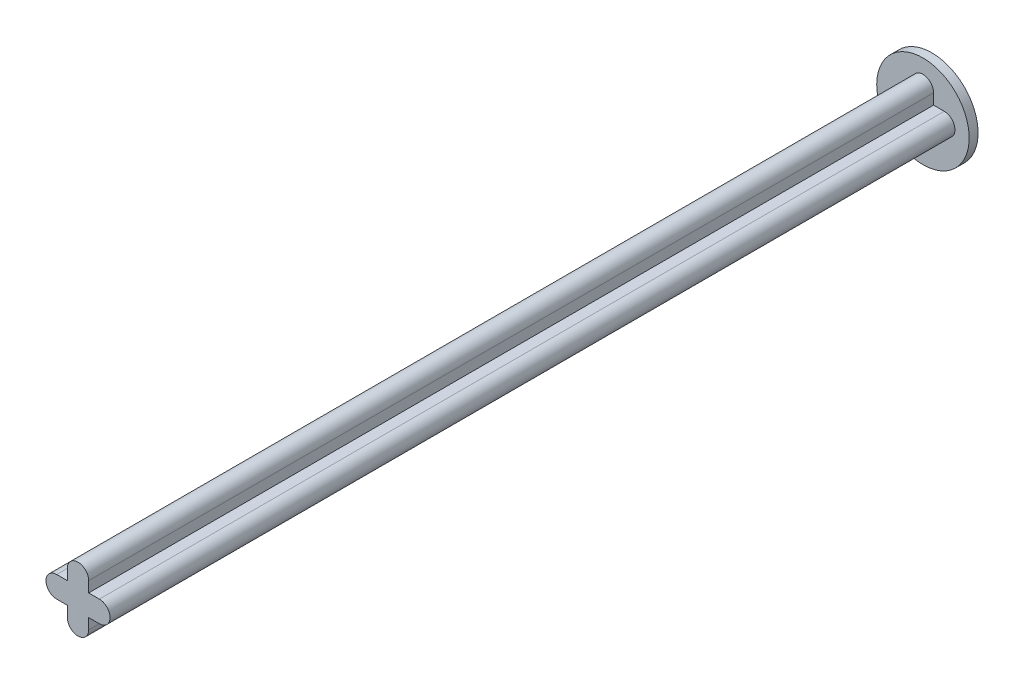
ISO-10303-21;
HEADER;
FILE_DESCRIPTION(('STEP AP214'),'2;1');
FILE_NAME('part.step','',(''),(''),'','','');
FILE_SCHEMA(('AUTOMOTIVE_DESIGN { 1 0 10303 214 1 1 1 1 }'));
ENDSEC;
DATA;
#1=APPLICATION_CONTEXT('core data for automotive mechanical design processes');
#2=APPLICATION_PROTOCOL_DEFINITION('international standard','automotive_design',2000,#1);
#3=PRODUCT_CONTEXT('',#1,'mechanical');
#4=PRODUCT('Part','Part','',(#3));
#5=PRODUCT_RELATED_PRODUCT_CATEGORY('part','',(#4));
#6=PRODUCT_DEFINITION_FORMATION('','',#4);
#7=PRODUCT_DEFINITION_CONTEXT('part definition',#1,'design');
#8=PRODUCT_DEFINITION('design','',#6,#7);
#9=PRODUCT_DEFINITION_SHAPE('','',#8);
#10=(LENGTH_UNIT() NAMED_UNIT(*) SI_UNIT(.MILLI.,.METRE.));
#11=(NAMED_UNIT(*) PLANE_ANGLE_UNIT() SI_UNIT($,.RADIAN.));
#12=(NAMED_UNIT(*) SI_UNIT($,.STERADIAN.) SOLID_ANGLE_UNIT());
#13=UNCERTAINTY_MEASURE_WITH_UNIT(LENGTH_MEASURE(1.E-05),#10,'distance_accuracy_value','');
#14=(GEOMETRIC_REPRESENTATION_CONTEXT(3) GLOBAL_UNCERTAINTY_ASSIGNED_CONTEXT((#13)) GLOBAL_UNIT_ASSIGNED_CONTEXT((#10,
#11,#12)) REPRESENTATION_CONTEXT('',''));
#15=CARTESIAN_POINT('',(0.,0.,0.));
#16=DIRECTION('',(0.,0.,1.));
#17=DIRECTION('',(1.,0.,0.));
#18=AXIS2_PLACEMENT_3D('',#15,#16,#17);
#19=CARTESIAN_POINT('',(1.524,0.762,60.96));
#20=DIRECTION('',(0.,1.,0.));
#21=DIRECTION('',(0.,0.,1.));
#22=AXIS2_PLACEMENT_3D('',#19,#20,#21);
#23=PLANE('',#22);
#24=DIRECTION('',(0.,0.,-1.));
#25=VECTOR('',#24,1.);
#26=CARTESIAN_POINT('',(0.762000000000001,0.762,60.96));
#27=LINE('',#26,#25);
#28=CARTESIAN_POINT('',(0.762000000000001,0.762,60.96));
#29=VERTEX_POINT('',#28);
#30=CARTESIAN_POINT('',(0.762000000000001,0.762,0.635000000000011));
#31=VERTEX_POINT('',#30);
#32=EDGE_CURVE('E134',#29,#31,#27,.T.);
#33=ORIENTED_EDGE('',*,*,#32,.T.);
#34=DIRECTION('',(-1.,0.,0.));
#35=VECTOR('',#34,1.);
#36=CARTESIAN_POINT('',(1.524,0.762,0.634999999999997));
#37=LINE('',#36,#35);
#38=CARTESIAN_POINT('',(0.,0.762,0.635000000000011));
#39=VERTEX_POINT('',#38);
#40=EDGE_CURVE('E50',#31,#39,#37,.T.);
#41=ORIENTED_EDGE('',*,*,#40,.T.);
#42=DIRECTION('',(0.,0.,-1.));
#43=VECTOR('',#42,1.);
#44=CARTESIAN_POINT('',(0.,0.762,60.96));
#45=LINE('',#44,#43);
#46=CARTESIAN_POINT('',(0.,0.762,60.96));
#47=VERTEX_POINT('',#46);
#48=EDGE_CURVE('E43',#47,#39,#45,.T.);
#49=ORIENTED_EDGE('',*,*,#48,.F.);
#50=DIRECTION('',(1.,0.,0.));
#51=VECTOR('',#50,1.);
#52=CARTESIAN_POINT('',(1.524,0.762,60.96));
#53=LINE('',#52,#51);
#54=EDGE_CURVE('E148',#47,#29,#53,.T.);
#55=ORIENTED_EDGE('',*,*,#54,.T.);
#56=EDGE_LOOP('',(#33,#41,#49,#55));
#57=FACE_BOUND('',#56,.T.);
#58=ADVANCED_FACE('F36',(#57),#23,.T.);
#59=CARTESIAN_POINT('',(0.,0.,60.96));
#60=DIRECTION('',(0.,0.,-1.));
#61=DIRECTION('',(-1.,0.,0.));
#62=AXIS2_PLACEMENT_3D('',#59,#60,#61);
#63=CYLINDRICAL_SURFACE('',#62,0.762);
#64=CARTESIAN_POINT('',(0.,0.,0.634999999999997));
#65=DIRECTION('',(0.,0.,-1.));
#66=DIRECTION('',(-1.,0.,0.));
#67=AXIS2_PLACEMENT_3D('',#64,#65,#66);
#68=CIRCLE('',#67,0.762);
#69=CARTESIAN_POINT('',(0.,-0.762,0.635000000000011));
#70=VERTEX_POINT('',#69);
#71=EDGE_CURVE('E57',#70,#39,#68,.T.);
#72=ORIENTED_EDGE('',*,*,#71,.F.);
#73=DIRECTION('',(0.,0.,-1.));
#74=VECTOR('',#73,1.);
#75=CARTESIAN_POINT('',(0.,-0.762,60.96));
#76=LINE('',#75,#74);
#77=CARTESIAN_POINT('',(0.,-0.762,60.96));
#78=VERTEX_POINT('',#77);
#79=EDGE_CURVE('E203',#78,#70,#76,.T.);
#80=ORIENTED_EDGE('',*,*,#79,.F.);
#81=CARTESIAN_POINT('',(0.,0.,60.96));
#82=DIRECTION('',(0.,0.,1.));
#83=DIRECTION('',(1.,0.,0.));
#84=AXIS2_PLACEMENT_3D('',#81,#82,#83);
#85=CIRCLE('',#84,0.762);
#86=EDGE_CURVE('E151',#47,#78,#85,.T.);
#87=ORIENTED_EDGE('',*,*,#86,.F.);
#88=ORIENTED_EDGE('',*,*,#48,.T.);
#89=EDGE_LOOP('',(#72,#80,#87,#88));
#90=FACE_BOUND('',#89,.T.);
#91=ADVANCED_FACE('F205',(#90),#63,.T.);
#92=CARTESIAN_POINT('',(1.524,-0.762,60.96));
#93=DIRECTION('',(0.,1.,0.));
#94=DIRECTION('',(0.,0.,1.));
#95=AXIS2_PLACEMENT_3D('',#92,#93,#94);
#96=PLANE('',#95);
#97=DIRECTION('',(-1.,0.,0.));
#98=VECTOR('',#97,1.);
#99=CARTESIAN_POINT('',(1.524,-0.762,0.634999999999997));
#100=LINE('',#99,#98);
#101=CARTESIAN_POINT('',(0.762000000000001,-0.762,0.635000000000011));
#102=VERTEX_POINT('',#101);
#103=EDGE_CURVE('E153',#102,#70,#100,.T.);
#104=ORIENTED_EDGE('',*,*,#103,.F.);
#105=DIRECTION('',(0.,0.,-1.));
#106=VECTOR('',#105,1.);
#107=CARTESIAN_POINT('',(0.762000000000001,-0.762,60.96));
#108=LINE('',#107,#106);
#109=CARTESIAN_POINT('',(0.762000000000001,-0.762,60.96));
#110=VERTEX_POINT('',#109);
#111=EDGE_CURVE('E200',#110,#102,#108,.T.);
#112=ORIENTED_EDGE('',*,*,#111,.F.);
#113=DIRECTION('',(1.,0.,0.));
#114=VECTOR('',#113,1.);
#115=CARTESIAN_POINT('',(1.524,-0.762,60.96));
#116=LINE('',#115,#114);
#117=EDGE_CURVE('E158',#78,#110,#116,.T.);
#118=ORIENTED_EDGE('',*,*,#117,.F.);
#119=ORIENTED_EDGE('',*,*,#79,.T.);
#120=EDGE_LOOP('',(#104,#112,#118,#119));
#121=FACE_BOUND('',#120,.T.);
#122=ADVANCED_FACE('F234',(#121),#96,.F.);
#123=CARTESIAN_POINT('',(0.762000000000001,-4.4302164435667,60.96));
#124=DIRECTION('',(1.,0.,0.));
#125=DIRECTION('',(0.,0.,-1.));
#126=AXIS2_PLACEMENT_3D('',#123,#124,#125);
#127=PLANE('',#126);
#128=DIRECTION('',(0.,1.,0.));
#129=VECTOR('',#128,1.);
#130=CARTESIAN_POINT('',(0.762000000000001,-4.4302164435667,0.634999999999997));
#131=LINE('',#130,#129);
#132=CARTESIAN_POINT('',(0.762000000000001,-1.524,0.635000000000011));
#133=VERTEX_POINT('',#132);
#134=EDGE_CURVE('E230',#133,#102,#131,.T.);
#135=ORIENTED_EDGE('',*,*,#134,.F.);
#136=DIRECTION('',(0.,0.,-1.));
#137=VECTOR('',#136,1.);
#138=CARTESIAN_POINT('',(0.762000000000001,-1.524,60.96));
#139=LINE('',#138,#137);
#140=CARTESIAN_POINT('',(0.762000000000001,-1.524,60.96));
#141=VERTEX_POINT('',#140);
#142=EDGE_CURVE('E197',#141,#133,#139,.T.);
#143=ORIENTED_EDGE('',*,*,#142,.F.);
#144=DIRECTION('',(0.,-1.,0.));
#145=VECTOR('',#144,1.);
#146=CARTESIAN_POINT('',(0.762000000000001,-4.4302164435667,60.96));
#147=LINE('',#146,#145);
#148=EDGE_CURVE('E160',#110,#141,#147,.T.);
#149=ORIENTED_EDGE('',*,*,#148,.F.);
#150=ORIENTED_EDGE('',*,*,#111,.T.);
#151=EDGE_LOOP('',(#135,#143,#149,#150));
#152=FACE_BOUND('',#151,.T.);
#153=ADVANCED_FACE('F238',(#152),#127,.F.);
#154=CARTESIAN_POINT('',(1.524,-1.524,60.96));
#155=DIRECTION('',(0.,0.,-1.));
#156=DIRECTION('',(-1.,0.,0.));
#157=AXIS2_PLACEMENT_3D('',#154,#155,#156);
#158=CYLINDRICAL_SURFACE('',#157,0.761999999999999);
#159=CARTESIAN_POINT('',(1.524,-1.524,0.634999999999997));
#160=DIRECTION('',(0.,0.,-1.));
#161=DIRECTION('',(-1.,0.,0.));
#162=AXIS2_PLACEMENT_3D('',#159,#160,#161);
#163=CIRCLE('',#162,0.761999999999999);
#164=CARTESIAN_POINT('',(2.286,-1.524,0.635000000000011));
#165=VERTEX_POINT('',#164);
#166=EDGE_CURVE('E227',#165,#133,#163,.T.);
#167=ORIENTED_EDGE('',*,*,#166,.F.);
#168=DIRECTION('',(0.,0.,-1.));
#169=VECTOR('',#168,1.);
#170=CARTESIAN_POINT('',(2.286,-1.524,60.96));
#171=LINE('',#170,#169);
#172=CARTESIAN_POINT('',(2.286,-1.524,60.96));
#173=VERTEX_POINT('',#172);
#174=EDGE_CURVE('E194',#173,#165,#171,.T.);
#175=ORIENTED_EDGE('',*,*,#174,.F.);
#176=CARTESIAN_POINT('',(1.524,-1.524,60.96));
#177=DIRECTION('',(0.,0.,1.));
#178=DIRECTION('',(1.,0.,0.));
#179=AXIS2_PLACEMENT_3D('',#176,#177,#178);
#180=CIRCLE('',#179,0.761999999999999);
#181=EDGE_CURVE('E162',#141,#173,#180,.T.);
#182=ORIENTED_EDGE('',*,*,#181,.F.);
#183=ORIENTED_EDGE('',*,*,#142,.T.);
#184=EDGE_LOOP('',(#167,#175,#182,#183));
#185=FACE_BOUND('',#184,.T.);
#186=ADVANCED_FACE('F244',(#185),#158,.T.);
#187=CARTESIAN_POINT('',(2.286,-4.4302164435667,60.96));
#188=DIRECTION('',(1.,0.,0.));
#189=DIRECTION('',(0.,0.,-1.));
#190=AXIS2_PLACEMENT_3D('',#187,#188,#189);
#191=PLANE('',#190);
#192=ORIENTED_EDGE('',*,*,#174,.T.);
#193=DIRECTION('',(0.,1.,0.));
#194=VECTOR('',#193,1.);
#195=CARTESIAN_POINT('',(2.286,-4.4302164435667,0.634999999999997));
#196=LINE('',#195,#194);
#197=CARTESIAN_POINT('',(2.286,-0.762,0.635000000000011));
#198=VERTEX_POINT('',#197);
#199=EDGE_CURVE('E225',#165,#198,#196,.T.);
#200=ORIENTED_EDGE('',*,*,#199,.T.);
#201=DIRECTION('',(0.,0.,-1.));
#202=VECTOR('',#201,1.);
#203=CARTESIAN_POINT('',(2.286,-0.762,60.96));
#204=LINE('',#203,#202);
#205=CARTESIAN_POINT('',(2.286,-0.762,60.96));
#206=VERTEX_POINT('',#205);
#207=EDGE_CURVE('E191',#206,#198,#204,.T.);
#208=ORIENTED_EDGE('',*,*,#207,.F.);
#209=DIRECTION('',(0.,-1.,0.));
#210=VECTOR('',#209,1.);
#211=CARTESIAN_POINT('',(2.286,-4.4302164435667,60.96));
#212=LINE('',#211,#210);
#213=EDGE_CURVE('E164',#206,#173,#212,.T.);
#214=ORIENTED_EDGE('',*,*,#213,.T.);
#215=EDGE_LOOP('',(#192,#200,#208,#214));
#216=FACE_BOUND('',#215,.T.);
#217=ADVANCED_FACE('F247',(#216),#191,.T.);
#218=CARTESIAN_POINT('',(1.524,-0.762,60.96));
#219=DIRECTION('',(0.,1.,0.));
#220=DIRECTION('',(0.,0.,1.));
#221=AXIS2_PLACEMENT_3D('',#218,#219,#220);
#222=PLANE('',#221);
#223=DIRECTION('',(-1.,0.,0.));
#224=VECTOR('',#223,1.);
#225=CARTESIAN_POINT('',(1.524,-0.762,0.634999999999997));
#226=LINE('',#225,#224);
#227=CARTESIAN_POINT('',(3.048,-0.762,0.635000000000011));
#228=VERTEX_POINT('',#227);
#229=EDGE_CURVE('E222',#228,#198,#226,.T.);
#230=ORIENTED_EDGE('',*,*,#229,.F.);
#231=DIRECTION('',(0.,0.,-1.));
#232=VECTOR('',#231,1.);
#233=CARTESIAN_POINT('',(3.048,-0.762,60.96));
#234=LINE('',#233,#232);
#235=CARTESIAN_POINT('',(3.048,-0.762,60.96));
#236=VERTEX_POINT('',#235);
#237=EDGE_CURVE('E188',#236,#228,#234,.T.);
#238=ORIENTED_EDGE('',*,*,#237,.F.);
#239=DIRECTION('',(1.,0.,0.));
#240=VECTOR('',#239,1.);
#241=CARTESIAN_POINT('',(1.524,-0.762,60.96));
#242=LINE('',#241,#240);
#243=EDGE_CURVE('E167',#206,#236,#242,.T.);
#244=ORIENTED_EDGE('',*,*,#243,.F.);
#245=ORIENTED_EDGE('',*,*,#207,.T.);
#246=EDGE_LOOP('',(#230,#238,#244,#245));
#247=FACE_BOUND('',#246,.T.);
#248=ADVANCED_FACE('F251',(#247),#222,.F.);
#249=CARTESIAN_POINT('',(3.048,0.,60.96));
#250=DIRECTION('',(0.,0.,-1.));
#251=DIRECTION('',(-1.,0.,0.));
#252=AXIS2_PLACEMENT_3D('',#249,#250,#251);
#253=CYLINDRICAL_SURFACE('',#252,0.762);
#254=CARTESIAN_POINT('',(3.048,0.,0.634999999999997));
#255=DIRECTION('',(0.,0.,-1.));
#256=DIRECTION('',(-1.,0.,0.));
#257=AXIS2_PLACEMENT_3D('',#254,#255,#256);
#258=CIRCLE('',#257,0.762);
#259=CARTESIAN_POINT('',(3.048,0.762,0.635000000000011));
#260=VERTEX_POINT('',#259);
#261=EDGE_CURVE('E216',#260,#228,#258,.T.);
#262=ORIENTED_EDGE('',*,*,#261,.F.);
#263=DIRECTION('',(0.,0.,-1.));
#264=VECTOR('',#263,1.);
#265=CARTESIAN_POINT('',(3.048,0.762,60.96));
#266=LINE('',#265,#264);
#267=CARTESIAN_POINT('',(3.048,0.762,60.96));
#268=VERTEX_POINT('',#267);
#269=EDGE_CURVE('E185',#268,#260,#266,.T.);
#270=ORIENTED_EDGE('',*,*,#269,.F.);
#271=CARTESIAN_POINT('',(3.048,0.,60.96));
#272=DIRECTION('',(0.,0.,1.));
#273=DIRECTION('',(1.,0.,0.));
#274=AXIS2_PLACEMENT_3D('',#271,#272,#273);
#275=CIRCLE('',#274,0.762);
#276=EDGE_CURVE('E169',#236,#268,#275,.T.);
#277=ORIENTED_EDGE('',*,*,#276,.F.);
#278=ORIENTED_EDGE('',*,*,#237,.T.);
#279=EDGE_LOOP('',(#262,#270,#277,#278));
#280=FACE_BOUND('',#279,.T.);
#281=ADVANCED_FACE('F255',(#280),#253,.T.);
#282=CARTESIAN_POINT('',(1.524,0.762,60.96));
#283=DIRECTION('',(0.,1.,0.));
#284=DIRECTION('',(0.,0.,1.));
#285=AXIS2_PLACEMENT_3D('',#282,#283,#284);
#286=PLANE('',#285);
#287=ORIENTED_EDGE('',*,*,#269,.T.);
#288=DIRECTION('',(-1.,0.,0.));
#289=VECTOR('',#288,1.);
#290=CARTESIAN_POINT('',(1.524,0.762,0.634999999999997));
#291=LINE('',#290,#289);
#292=CARTESIAN_POINT('',(2.286,0.762,0.635000000000011));
#293=VERTEX_POINT('',#292);
#294=EDGE_CURVE('E214',#260,#293,#291,.T.);
#295=ORIENTED_EDGE('',*,*,#294,.T.);
#296=DIRECTION('',(0.,0.,-1.));
#297=VECTOR('',#296,1.);
#298=CARTESIAN_POINT('',(2.286,0.762,60.96));
#299=LINE('',#298,#297);
#300=CARTESIAN_POINT('',(2.286,0.762,60.96));
#301=VERTEX_POINT('',#300);
#302=EDGE_CURVE('E182',#301,#293,#299,.T.);
#303=ORIENTED_EDGE('',*,*,#302,.F.);
#304=DIRECTION('',(1.,0.,0.));
#305=VECTOR('',#304,1.);
#306=CARTESIAN_POINT('',(1.524,0.762,60.96));
#307=LINE('',#306,#305);
#308=EDGE_CURVE('E171',#301,#268,#307,.T.);
#309=ORIENTED_EDGE('',*,*,#308,.T.);
#310=EDGE_LOOP('',(#287,#295,#303,#309));
#311=FACE_BOUND('',#310,.T.);
#312=ADVANCED_FACE('F257',(#311),#286,.T.);
#313=CARTESIAN_POINT('',(2.286,-4.4302164435667,60.96));
#314=DIRECTION('',(1.,0.,0.));
#315=DIRECTION('',(0.,0.,-1.));
#316=AXIS2_PLACEMENT_3D('',#313,#314,#315);
#317=PLANE('',#316);
#318=ORIENTED_EDGE('',*,*,#302,.T.);
#319=DIRECTION('',(0.,1.,0.));
#320=VECTOR('',#319,1.);
#321=CARTESIAN_POINT('',(2.286,-4.4302164435667,0.634999999999997));
#322=LINE('',#321,#320);
#323=CARTESIAN_POINT('',(2.286,1.524,0.635000000000011));
#324=VERTEX_POINT('',#323);
#325=EDGE_CURVE('E142',#293,#324,#322,.T.);
#326=ORIENTED_EDGE('',*,*,#325,.T.);
#327=DIRECTION('',(0.,0.,-1.));
#328=VECTOR('',#327,1.);
#329=CARTESIAN_POINT('',(2.286,1.524,60.96));
#330=LINE('',#329,#328);
#331=CARTESIAN_POINT('',(2.286,1.524,60.96));
#332=VERTEX_POINT('',#331);
#333=EDGE_CURVE('E133',#332,#324,#330,.T.);
#334=ORIENTED_EDGE('',*,*,#333,.F.);
#335=DIRECTION('',(0.,-1.,0.));
#336=VECTOR('',#335,1.);
#337=CARTESIAN_POINT('',(2.286,-4.4302164435667,60.96));
#338=LINE('',#337,#336);
#339=EDGE_CURVE('E174',#332,#301,#338,.T.);
#340=ORIENTED_EDGE('',*,*,#339,.T.);
#341=EDGE_LOOP('',(#318,#326,#334,#340));
#342=FACE_BOUND('',#341,.T.);
#343=ADVANCED_FACE('F212',(#342),#317,.T.);
#344=CARTESIAN_POINT('',(1.524,1.524,60.96));
#345=DIRECTION('',(0.,0.,-1.));
#346=DIRECTION('',(-1.,0.,0.));
#347=AXIS2_PLACEMENT_3D('',#344,#345,#346);
#348=CYLINDRICAL_SURFACE('',#347,0.761999999999999);
#349=CARTESIAN_POINT('',(1.524,1.524,0.634999999999997));
#350=DIRECTION('',(0.,0.,-1.));
#351=DIRECTION('',(-1.,0.,0.));
#352=AXIS2_PLACEMENT_3D('',#349,#350,#351);
#353=CIRCLE('',#352,0.761999999999999);
#354=CARTESIAN_POINT('',(0.762000000000001,1.524,0.634999999999997));
#355=VERTEX_POINT('',#354);
#356=EDGE_CURVE('E138',#355,#324,#353,.T.);
#357=ORIENTED_EDGE('',*,*,#356,.F.);
#358=DIRECTION('',(0.,0.,-1.));
#359=VECTOR('',#358,1.);
#360=CARTESIAN_POINT('',(0.762000000000001,1.524,60.96));
#361=LINE('',#360,#359);
#362=CARTESIAN_POINT('',(0.762000000000001,1.524,60.96));
#363=VERTEX_POINT('',#362);
#364=EDGE_CURVE('E126',#363,#355,#361,.T.);
#365=ORIENTED_EDGE('',*,*,#364,.F.);
#366=CARTESIAN_POINT('',(1.524,1.524,60.96));
#367=DIRECTION('',(0.,0.,1.));
#368=DIRECTION('',(1.,0.,0.));
#369=AXIS2_PLACEMENT_3D('',#366,#367,#368);
#370=CIRCLE('',#369,0.761999999999999);
#371=EDGE_CURVE('E177',#332,#363,#370,.T.);
#372=ORIENTED_EDGE('',*,*,#371,.F.);
#373=ORIENTED_EDGE('',*,*,#333,.T.);
#374=EDGE_LOOP('',(#357,#365,#372,#373));
#375=FACE_BOUND('',#374,.T.);
#376=ADVANCED_FACE('F139',(#375),#348,.T.);
#377=CARTESIAN_POINT('',(0.762000000000001,-4.4302164435667,60.96));
#378=DIRECTION('',(1.,0.,0.));
#379=DIRECTION('',(0.,0.,-1.));
#380=AXIS2_PLACEMENT_3D('',#377,#378,#379);
#381=PLANE('',#380);
#382=DIRECTION('',(0.,1.,0.));
#383=VECTOR('',#382,1.);
#384=CARTESIAN_POINT('',(0.762000000000001,-4.4302164435667,0.634999999999997));
#385=LINE('',#384,#383);
#386=EDGE_CURVE('E11',#31,#355,#385,.T.);
#387=ORIENTED_EDGE('',*,*,#386,.F.);
#388=ORIENTED_EDGE('',*,*,#32,.F.);
#389=DIRECTION('',(0.,-1.,0.));
#390=VECTOR('',#389,1.);
#391=CARTESIAN_POINT('',(0.762000000000001,-4.4302164435667,60.96));
#392=LINE('',#391,#390);
#393=EDGE_CURVE('E130',#363,#29,#392,.T.);
#394=ORIENTED_EDGE('',*,*,#393,.F.);
#395=ORIENTED_EDGE('',*,*,#364,.T.);
#396=EDGE_LOOP('',(#387,#388,#394,#395));
#397=FACE_BOUND('',#396,.T.);
#398=ADVANCED_FACE('F128',(#397),#381,.F.);
#399=CARTESIAN_POINT('',(1.524,-4.4302164435667,60.96));
#400=DIRECTION('',(0.,0.,1.));
#401=DIRECTION('',(1.,0.,0.));
#402=AXIS2_PLACEMENT_3D('',#399,#400,#401);
#403=PLANE('',#402);
#404=ORIENTED_EDGE('',*,*,#54,.F.);
#405=ORIENTED_EDGE('',*,*,#86,.T.);
#406=ORIENTED_EDGE('',*,*,#117,.T.);
#407=ORIENTED_EDGE('',*,*,#148,.T.);
#408=ORIENTED_EDGE('',*,*,#181,.T.);
#409=ORIENTED_EDGE('',*,*,#213,.F.);
#410=ORIENTED_EDGE('',*,*,#243,.T.);
#411=ORIENTED_EDGE('',*,*,#276,.T.);
#412=ORIENTED_EDGE('',*,*,#308,.F.);
#413=ORIENTED_EDGE('',*,*,#339,.F.);
#414=ORIENTED_EDGE('',*,*,#371,.T.);
#415=ORIENTED_EDGE('',*,*,#393,.T.);
#416=EDGE_LOOP('',(#404,#405,#406,#407,#408,#409,#410,#411,#412,#413,#414,#415));
#417=FACE_BOUND('',#416,.T.);
#418=ADVANCED_FACE('F208',(#417),#403,.T.);
#419=CARTESIAN_POINT('',(1.524,0.,0.635));
#420=DIRECTION('',(0.,0.,-1.));
#421=DIRECTION('',(-1.,0.,0.));
#422=AXIS2_PLACEMENT_3D('',#419,#420,#421);
#423=CYLINDRICAL_SURFACE('',#422,3.302);
#424=CARTESIAN_POINT('',(1.524,0.,0.635));
#425=DIRECTION('',(0.,0.,-1.));
#426=DIRECTION('',(-1.,0.,0.));
#427=AXIS2_PLACEMENT_3D('',#424,#425,#426);
#428=CIRCLE('',#427,3.302);
#429=CARTESIAN_POINT('',(-1.778,0.,0.635));
#430=VERTEX_POINT('',#429);
#431=EDGE_CURVE('E143',#430,#430,#428,.T.);
#432=ORIENTED_EDGE('',*,*,#431,.T.);
#433=EDGE_LOOP('',(#432));
#434=FACE_BOUND('',#433,.T.);
#435=CARTESIAN_POINT('',(1.524,0.,0.));
#436=DIRECTION('',(0.,0.,-1.));
#437=DIRECTION('',(-1.,0.,0.));
#438=AXIS2_PLACEMENT_3D('',#435,#436,#437);
#439=CIRCLE('',#438,3.302);
#440=CARTESIAN_POINT('',(-1.778,0.,0.));
#441=VERTEX_POINT('',#440);
#442=EDGE_CURVE('E411',#441,#441,#439,.T.);
#443=ORIENTED_EDGE('',*,*,#442,.F.);
#444=EDGE_LOOP('',(#443));
#445=FACE_BOUND('',#444,.T.);
#446=ADVANCED_FACE('F323',(#434,#445),#423,.T.);
#447=CARTESIAN_POINT('',(1.524,0.,0.635));
#448=DIRECTION('',(0.,0.,-1.));
#449=DIRECTION('',(-1.,0.,0.));
#450=AXIS2_PLACEMENT_3D('',#447,#448,#449);
#451=PLANE('',#450);
#452=ORIENTED_EDGE('',*,*,#40,.F.);
#453=ORIENTED_EDGE('',*,*,#386,.T.);
#454=ORIENTED_EDGE('',*,*,#356,.T.);
#455=ORIENTED_EDGE('',*,*,#325,.F.);
#456=ORIENTED_EDGE('',*,*,#294,.F.);
#457=ORIENTED_EDGE('',*,*,#261,.T.);
#458=ORIENTED_EDGE('',*,*,#229,.T.);
#459=ORIENTED_EDGE('',*,*,#199,.F.);
#460=ORIENTED_EDGE('',*,*,#166,.T.);
#461=ORIENTED_EDGE('',*,*,#134,.T.);
#462=ORIENTED_EDGE('',*,*,#103,.T.);
#463=ORIENTED_EDGE('',*,*,#71,.T.);
#464=EDGE_LOOP('',(#452,#453,#454,#455,#456,#457,#458,#459,#460,#461,#462,#463));
#465=FACE_BOUND('',#464,.T.);
#466=ORIENTED_EDGE('',*,*,#431,.F.);
#467=EDGE_LOOP('',(#466));
#468=FACE_BOUND('',#467,.T.);
#469=ADVANCED_FACE('F145',(#465,#468),#451,.F.);
#470=CARTESIAN_POINT('',(1.524,-4.4302164435667,0.));
#471=DIRECTION('',(0.,0.,1.));
#472=DIRECTION('',(1.,0.,0.));
#473=AXIS2_PLACEMENT_3D('',#470,#471,#472);
#474=PLANE('',#473);
#475=ORIENTED_EDGE('',*,*,#442,.T.);
#476=EDGE_LOOP('',(#475));
#477=FACE_BOUND('',#476,.T.);
#478=ADVANCED_FACE('F338',(#477),#474,.F.);
#479=CLOSED_SHELL('',(#58,#91,#122,#153,#186,#217,#248,#281,#312,#343,#376,#398,#418,#446,#469,#478));
#480=MANIFOLD_SOLID_BREP('B2',#479);
#481=ADVANCED_BREP_SHAPE_REPRESENTATION('',(#18,#480),#14);
#482=SHAPE_DEFINITION_REPRESENTATION(#9,#481);
ENDSEC;
END-ISO-10303-21;
